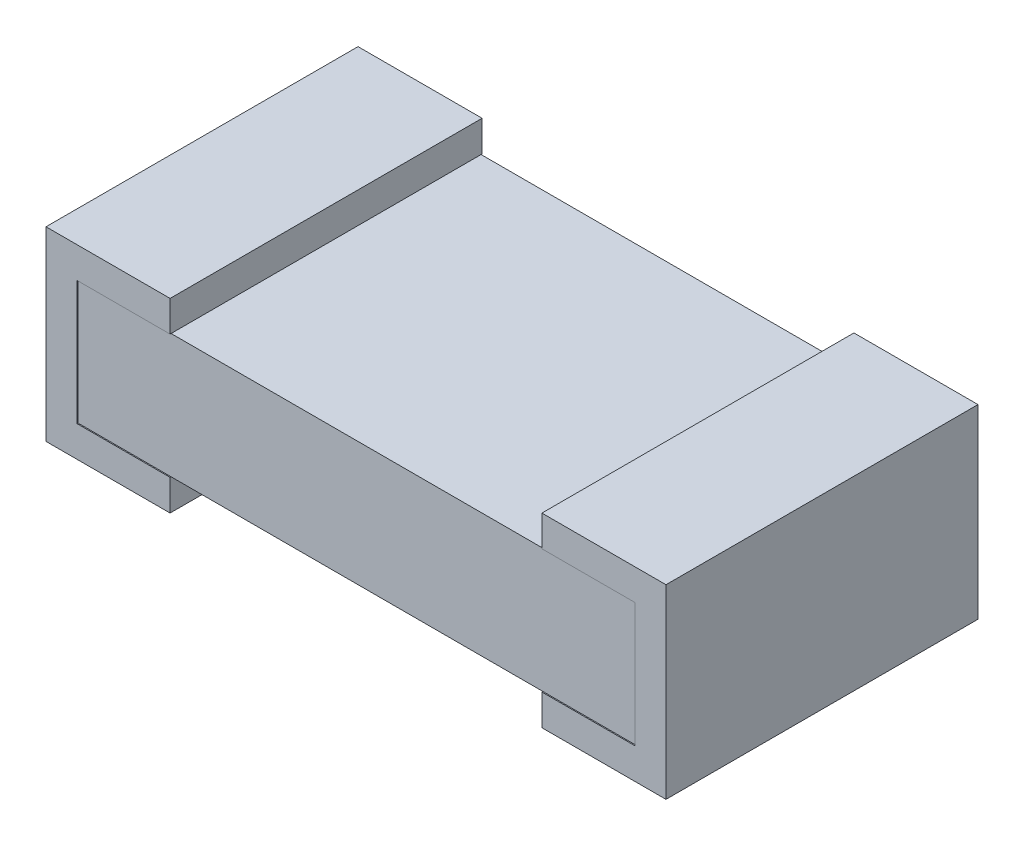
ISO-10303-21;
HEADER;
FILE_DESCRIPTION(('STEP AP214'),'2;1');
FILE_NAME('part.step','',(''),(''),'','','');
FILE_SCHEMA(('AUTOMOTIVE_DESIGN { 1 0 10303 214 1 1 1 1 }'));
ENDSEC;
DATA;
#1=APPLICATION_CONTEXT('core data for automotive mechanical design processes');
#2=APPLICATION_PROTOCOL_DEFINITION('international standard','automotive_design',2000,#1);
#3=PRODUCT_CONTEXT('',#1,'mechanical');
#4=PRODUCT('Part','Part','',(#3));
#5=PRODUCT_RELATED_PRODUCT_CATEGORY('part','',(#4));
#6=PRODUCT_DEFINITION_FORMATION('','',#4);
#7=PRODUCT_DEFINITION_CONTEXT('part definition',#1,'design');
#8=PRODUCT_DEFINITION('design','',#6,#7);
#9=PRODUCT_DEFINITION_SHAPE('','',#8);
#10=(LENGTH_UNIT() NAMED_UNIT(*) SI_UNIT(.MILLI.,.METRE.));
#11=(NAMED_UNIT(*) PLANE_ANGLE_UNIT() SI_UNIT($,.RADIAN.));
#12=(NAMED_UNIT(*) SI_UNIT($,.STERADIAN.) SOLID_ANGLE_UNIT());
#13=UNCERTAINTY_MEASURE_WITH_UNIT(LENGTH_MEASURE(1.E-05),#10,'distance_accuracy_value','');
#14=(GEOMETRIC_REPRESENTATION_CONTEXT(3) GLOBAL_UNCERTAINTY_ASSIGNED_CONTEXT((#13)) GLOBAL_UNIT_ASSIGNED_CONTEXT((#10,
#11,#12)) REPRESENTATION_CONTEXT('',''));
#15=CARTESIAN_POINT('',(0.,0.,0.));
#16=DIRECTION('',(0.,0.,1.));
#17=DIRECTION('',(1.,0.,0.));
#18=AXIS2_PLACEMENT_3D('',#15,#16,#17);
#19=CARTESIAN_POINT('',(-0.457,-0.2285,0.3835));
#20=DIRECTION('',(0.,1.,0.));
#21=DIRECTION('',(-1.,0.,0.));
#22=AXIS2_PLACEMENT_3D('',#19,#20,#21);
#23=PLANE('',#22);
#24=DIRECTION('',(0.,0.,1.));
#25=VECTOR('',#24,1.);
#26=CARTESIAN_POINT('',(-0.457,-0.2285,0.3835));
#27=LINE('',#26,#25);
#28=CARTESIAN_POINT('',(-0.457,-0.2285,-0.3835));
#29=VERTEX_POINT('',#28);
#30=CARTESIAN_POINT('',(-0.457,-0.2285,0.3835));
#31=VERTEX_POINT('',#30);
#32=EDGE_CURVE('E180',#29,#31,#27,.T.);
#33=ORIENTED_EDGE('',*,*,#32,.T.);
#34=DIRECTION('',(-1.,0.,0.));
#35=VECTOR('',#34,1.);
#36=CARTESIAN_POINT('',(-0.457,-0.2285,0.3835));
#37=LINE('',#36,#35);
#38=CARTESIAN_POINT('',(-0.762,-0.2285,0.3835));
#39=VERTEX_POINT('',#38);
#40=EDGE_CURVE('E182',#31,#39,#37,.T.);
#41=ORIENTED_EDGE('',*,*,#40,.T.);
#42=DIRECTION('',(0.,0.,-1.));
#43=VECTOR('',#42,1.);
#44=CARTESIAN_POINT('',(-0.762,-0.2285,0.3835));
#45=LINE('',#44,#43);
#46=CARTESIAN_POINT('',(-0.762,-0.2285,-0.3835));
#47=VERTEX_POINT('',#46);
#48=EDGE_CURVE('E20',#39,#47,#45,.T.);
#49=ORIENTED_EDGE('',*,*,#48,.T.);
#50=DIRECTION('',(-1.,0.,0.));
#51=VECTOR('',#50,1.);
#52=CARTESIAN_POINT('',(-0.457,-0.2285,-0.3835));
#53=LINE('',#52,#51);
#54=EDGE_CURVE('E183',#29,#47,#53,.T.);
#55=ORIENTED_EDGE('',*,*,#54,.F.);
#56=EDGE_LOOP('',(#33,#41,#49,#55));
#57=FACE_BOUND('',#56,.T.);
#58=ADVANCED_FACE('F17',(#57),#23,.F.);
#59=CARTESIAN_POINT('',(-0.762,-0.2285,0.3835));
#60=DIRECTION('',(1.,0.,0.));
#61=DIRECTION('',(0.,0.,-1.));
#62=AXIS2_PLACEMENT_3D('',#59,#60,#61);
#63=PLANE('',#62);
#64=ORIENTED_EDGE('',*,*,#48,.F.);
#65=DIRECTION('',(0.,1.,0.));
#66=VECTOR('',#65,1.);
#67=CARTESIAN_POINT('',(-0.762,0.1525,0.3835));
#68=LINE('',#67,#66);
#69=CARTESIAN_POINT('',(-0.762,0.2285,0.3835));
#70=VERTEX_POINT('',#69);
#71=EDGE_CURVE('E195',#39,#70,#68,.T.);
#72=ORIENTED_EDGE('',*,*,#71,.T.);
#73=DIRECTION('',(0.,0.,-1.));
#74=VECTOR('',#73,1.);
#75=CARTESIAN_POINT('',(-0.762,0.2285,0.3835));
#76=LINE('',#75,#74);
#77=CARTESIAN_POINT('',(-0.762,0.2285,-0.3835));
#78=VERTEX_POINT('',#77);
#79=EDGE_CURVE('E213',#70,#78,#76,.T.);
#80=ORIENTED_EDGE('',*,*,#79,.T.);
#81=DIRECTION('',(0.,1.,0.));
#82=VECTOR('',#81,1.);
#83=CARTESIAN_POINT('',(-0.762,0.1525,-0.3835));
#84=LINE('',#83,#82);
#85=EDGE_CURVE('E210',#47,#78,#84,.T.);
#86=ORIENTED_EDGE('',*,*,#85,.F.);
#87=EDGE_LOOP('',(#64,#72,#80,#86));
#88=FACE_BOUND('',#87,.T.);
#89=ADVANCED_FACE('F211',(#88),#63,.F.);
#90=CARTESIAN_POINT('',(0.457,-0.2285,0.3835));
#91=DIRECTION('',(0.,-1.,0.));
#92=DIRECTION('',(1.,0.,0.));
#93=AXIS2_PLACEMENT_3D('',#90,#91,#92);
#94=PLANE('',#93);
#95=DIRECTION('',(-1.,0.,0.));
#96=VECTOR('',#95,1.);
#97=CARTESIAN_POINT('',(0.457,-0.2285,0.3835));
#98=LINE('',#97,#96);
#99=CARTESIAN_POINT('',(0.762,-0.2285,0.3835));
#100=VERTEX_POINT('',#99);
#101=CARTESIAN_POINT('',(0.457,-0.2285,0.3835));
#102=VERTEX_POINT('',#101);
#103=EDGE_CURVE('E290',#100,#102,#98,.T.);
#104=ORIENTED_EDGE('',*,*,#103,.T.);
#105=DIRECTION('',(0.,0.,1.));
#106=VECTOR('',#105,1.);
#107=CARTESIAN_POINT('',(0.457,-0.2285,0.3835));
#108=LINE('',#107,#106);
#109=CARTESIAN_POINT('',(0.457,-0.2285,-0.3835));
#110=VERTEX_POINT('',#109);
#111=EDGE_CURVE('E188',#110,#102,#108,.T.);
#112=ORIENTED_EDGE('',*,*,#111,.F.);
#113=DIRECTION('',(-1.,0.,0.));
#114=VECTOR('',#113,1.);
#115=CARTESIAN_POINT('',(0.457,-0.2285,-0.3835));
#116=LINE('',#115,#114);
#117=CARTESIAN_POINT('',(0.762,-0.2285,-0.3835));
#118=VERTEX_POINT('',#117);
#119=EDGE_CURVE('E307',#118,#110,#116,.T.);
#120=ORIENTED_EDGE('',*,*,#119,.F.);
#121=DIRECTION('',(0.,0.,-1.));
#122=VECTOR('',#121,1.);
#123=CARTESIAN_POINT('',(0.762,-0.2285,0.3835));
#124=LINE('',#123,#122);
#125=EDGE_CURVE('E205',#100,#118,#124,.T.);
#126=ORIENTED_EDGE('',*,*,#125,.F.);
#127=EDGE_LOOP('',(#104,#112,#120,#126));
#128=FACE_BOUND('',#127,.T.);
#129=ADVANCED_FACE('F460',(#128),#94,.T.);
#130=CARTESIAN_POINT('',(0.762,-0.2285,0.3835));
#131=DIRECTION('',(1.,0.,0.));
#132=DIRECTION('',(0.,0.,-1.));
#133=AXIS2_PLACEMENT_3D('',#130,#131,#132);
#134=PLANE('',#133);
#135=DIRECTION('',(0.,1.,0.));
#136=VECTOR('',#135,1.);
#137=CARTESIAN_POINT('',(0.762,0.1525,0.3835));
#138=LINE('',#137,#136);
#139=CARTESIAN_POINT('',(0.762,0.2285,0.3835));
#140=VERTEX_POINT('',#139);
#141=EDGE_CURVE('E293',#140,#100,#138,.F.);
#142=ORIENTED_EDGE('',*,*,#141,.T.);
#143=ORIENTED_EDGE('',*,*,#125,.T.);
#144=DIRECTION('',(0.,1.,0.));
#145=VECTOR('',#144,1.);
#146=CARTESIAN_POINT('',(0.762,0.1525,-0.3835));
#147=LINE('',#146,#145);
#148=CARTESIAN_POINT('',(0.762,0.2285,-0.3835));
#149=VERTEX_POINT('',#148);
#150=EDGE_CURVE('E309',#149,#118,#147,.F.);
#151=ORIENTED_EDGE('',*,*,#150,.F.);
#152=DIRECTION('',(0.,0.,1.));
#153=VECTOR('',#152,1.);
#154=CARTESIAN_POINT('',(0.762,0.2285,0.3835));
#155=LINE('',#154,#153);
#156=EDGE_CURVE('E279',#140,#149,#155,.F.);
#157=ORIENTED_EDGE('',*,*,#156,.F.);
#158=EDGE_LOOP('',(#142,#143,#151,#157));
#159=FACE_BOUND('',#158,.T.);
#160=ADVANCED_FACE('F462',(#159),#134,.T.);
#161=CARTESIAN_POINT('',(0.457,-0.1525,0.3835));
#162=DIRECTION('',(-1.,0.,0.));
#163=DIRECTION('',(0.,-1.,0.));
#164=AXIS2_PLACEMENT_3D('',#161,#162,#163);
#165=PLANE('',#164);
#166=DIRECTION('',(0.,0.,1.));
#167=VECTOR('',#166,1.);
#168=CARTESIAN_POINT('',(0.457,-0.1525,0.381));
#169=LINE('',#168,#167);
#170=CARTESIAN_POINT('',(0.457,-0.1525,0.381));
#171=VERTEX_POINT('',#170);
#172=CARTESIAN_POINT('',(0.457,-0.1525,-0.381));
#173=VERTEX_POINT('',#172);
#174=EDGE_CURVE('E270',#171,#173,#169,.F.);
#175=ORIENTED_EDGE('',*,*,#174,.T.);
#176=DIRECTION('',(0.,0.,1.));
#177=VECTOR('',#176,1.);
#178=CARTESIAN_POINT('',(0.457,-0.1525,0.3835));
#179=LINE('',#178,#177);
#180=CARTESIAN_POINT('',(0.457,-0.1525,-0.3835));
#181=VERTEX_POINT('',#180);
#182=EDGE_CURVE('E218',#181,#173,#179,.T.);
#183=ORIENTED_EDGE('',*,*,#182,.F.);
#184=DIRECTION('',(0.,1.,0.));
#185=VECTOR('',#184,1.);
#186=CARTESIAN_POINT('',(0.457,0.1525,-0.3835));
#187=LINE('',#186,#185);
#188=EDGE_CURVE('E305',#110,#181,#187,.T.);
#189=ORIENTED_EDGE('',*,*,#188,.F.);
#190=ORIENTED_EDGE('',*,*,#111,.T.);
#191=DIRECTION('',(0.,1.,0.));
#192=VECTOR('',#191,1.);
#193=CARTESIAN_POINT('',(0.457,0.1525,0.3835));
#194=LINE('',#193,#192);
#195=CARTESIAN_POINT('',(0.457,-0.1525,0.3835));
#196=VERTEX_POINT('',#195);
#197=EDGE_CURVE('E287',#102,#196,#194,.T.);
#198=ORIENTED_EDGE('',*,*,#197,.T.);
#199=DIRECTION('',(0.,0.,1.));
#200=VECTOR('',#199,1.);
#201=CARTESIAN_POINT('',(0.457,-0.1525,0.3835));
#202=LINE('',#201,#200);
#203=EDGE_CURVE('E277',#171,#196,#202,.T.);
#204=ORIENTED_EDGE('',*,*,#203,.F.);
#205=EDGE_LOOP('',(#175,#183,#189,#190,#198,#204));
#206=FACE_BOUND('',#205,.T.);
#207=ADVANCED_FACE('F350',(#206),#165,.T.);
#208=CARTESIAN_POINT('',(-0.457,-0.1525,0.3835));
#209=DIRECTION('',(-1.,0.,0.));
#210=DIRECTION('',(0.,-1.,0.));
#211=AXIS2_PLACEMENT_3D('',#208,#209,#210);
#212=PLANE('',#211);
#213=DIRECTION('',(0.,0.,-1.));
#214=VECTOR('',#213,1.);
#215=CARTESIAN_POINT('',(-0.457,-0.1525,0.3835));
#216=LINE('',#215,#214);
#217=CARTESIAN_POINT('',(-0.457,-0.1525,-0.3835));
#218=VERTEX_POINT('',#217);
#219=CARTESIAN_POINT('',(-0.457,-0.1525,-0.381));
#220=VERTEX_POINT('',#219);
#221=EDGE_CURVE('E323',#218,#220,#216,.F.);
#222=ORIENTED_EDGE('',*,*,#221,.T.);
#223=DIRECTION('',(0.,0.,1.));
#224=VECTOR('',#223,1.);
#225=CARTESIAN_POINT('',(-0.457,-0.1525,0.381));
#226=LINE('',#225,#224);
#227=CARTESIAN_POINT('',(-0.457,-0.1525,0.381));
#228=VERTEX_POINT('',#227);
#229=EDGE_CURVE('E273',#220,#228,#226,.T.);
#230=ORIENTED_EDGE('',*,*,#229,.T.);
#231=DIRECTION('',(0.,0.,-1.));
#232=VECTOR('',#231,1.);
#233=CARTESIAN_POINT('',(-0.457,-0.1525,0.3835));
#234=LINE('',#233,#232);
#235=CARTESIAN_POINT('',(-0.457,-0.1525,0.3835));
#236=VERTEX_POINT('',#235);
#237=EDGE_CURVE('E201',#228,#236,#234,.F.);
#238=ORIENTED_EDGE('',*,*,#237,.T.);
#239=DIRECTION('',(0.,1.,0.));
#240=VECTOR('',#239,1.);
#241=CARTESIAN_POINT('',(-0.457,0.1525,0.3835));
#242=LINE('',#241,#240);
#243=EDGE_CURVE('E187',#236,#31,#242,.F.);
#244=ORIENTED_EDGE('',*,*,#243,.T.);
#245=ORIENTED_EDGE('',*,*,#32,.F.);
#246=DIRECTION('',(0.,1.,0.));
#247=VECTOR('',#246,1.);
#248=CARTESIAN_POINT('',(-0.457,0.1525,-0.3835));
#249=LINE('',#248,#247);
#250=EDGE_CURVE('E220',#218,#29,#249,.F.);
#251=ORIENTED_EDGE('',*,*,#250,.F.);
#252=EDGE_LOOP('',(#222,#230,#238,#244,#245,#251));
#253=FACE_BOUND('',#252,.T.);
#254=ADVANCED_FACE('F199',(#253),#212,.F.);
#255=CARTESIAN_POINT('',(-0.457,0.1525,0.3835));
#256=DIRECTION('',(0.,0.,-1.));
#257=DIRECTION('',(-1.,0.,0.));
#258=AXIS2_PLACEMENT_3D('',#255,#256,#257);
#259=PLANE('',#258);
#260=DIRECTION('',(1.,0.,0.));
#261=VECTOR('',#260,1.);
#262=CARTESIAN_POINT('',(-0.762,0.2285,0.3835));
#263=LINE('',#262,#261);
#264=CARTESIAN_POINT('',(-0.457,0.2285,0.3835));
#265=VERTEX_POINT('',#264);
#266=EDGE_CURVE('E226',#265,#70,#263,.F.);
#267=ORIENTED_EDGE('',*,*,#266,.T.);
#268=ORIENTED_EDGE('',*,*,#71,.F.);
#269=ORIENTED_EDGE('',*,*,#40,.F.);
#270=ORIENTED_EDGE('',*,*,#243,.F.);
#271=DIRECTION('',(1.,0.,0.));
#272=VECTOR('',#271,1.);
#273=CARTESIAN_POINT('',(-0.686,-0.1525,0.3835));
#274=LINE('',#273,#272);
#275=CARTESIAN_POINT('',(-0.686,-0.1525,0.3835));
#276=VERTEX_POINT('',#275);
#277=EDGE_CURVE('E268',#236,#276,#274,.F.);
#278=ORIENTED_EDGE('',*,*,#277,.T.);
#279=DIRECTION('',(0.,1.,0.));
#280=VECTOR('',#279,1.);
#281=CARTESIAN_POINT('',(-0.686,0.1525,0.3835));
#282=LINE('',#281,#280);
#283=CARTESIAN_POINT('',(-0.686,0.1525,0.3835));
#284=VERTEX_POINT('',#283);
#285=EDGE_CURVE('E265',#276,#284,#282,.T.);
#286=ORIENTED_EDGE('',*,*,#285,.T.);
#287=DIRECTION('',(1.,0.,0.));
#288=VECTOR('',#287,1.);
#289=CARTESIAN_POINT('',(-0.457,0.1525,0.3835));
#290=LINE('',#289,#288);
#291=CARTESIAN_POINT('',(-0.457,0.1525,0.3835));
#292=VERTEX_POINT('',#291);
#293=EDGE_CURVE('E235',#284,#292,#290,.T.);
#294=ORIENTED_EDGE('',*,*,#293,.T.);
#295=DIRECTION('',(0.,-1.,0.));
#296=VECTOR('',#295,1.);
#297=CARTESIAN_POINT('',(-0.457,0.2285,0.3835));
#298=LINE('',#297,#296);
#299=EDGE_CURVE('E233',#292,#265,#298,.F.);
#300=ORIENTED_EDGE('',*,*,#299,.T.);
#301=EDGE_LOOP('',(#267,#268,#269,#270,#278,#286,#294,#300));
#302=FACE_BOUND('',#301,.T.);
#303=ADVANCED_FACE('F192',(#302),#259,.F.);
#304=CARTESIAN_POINT('',(-0.762,0.2285,0.3835));
#305=DIRECTION('',(0.,-1.,0.));
#306=DIRECTION('',(0.,0.,-1.));
#307=AXIS2_PLACEMENT_3D('',#304,#305,#306);
#308=PLANE('',#307);
#309=ORIENTED_EDGE('',*,*,#79,.F.);
#310=ORIENTED_EDGE('',*,*,#266,.F.);
#311=DIRECTION('',(0.,0.,1.));
#312=VECTOR('',#311,1.);
#313=CARTESIAN_POINT('',(-0.457,0.2285,0.3835));
#314=LINE('',#313,#312);
#315=CARTESIAN_POINT('',(-0.457,0.2285,-0.3835));
#316=VERTEX_POINT('',#315);
#317=EDGE_CURVE('E238',#265,#316,#314,.F.);
#318=ORIENTED_EDGE('',*,*,#317,.T.);
#319=DIRECTION('',(-1.,0.,0.));
#320=VECTOR('',#319,1.);
#321=CARTESIAN_POINT('',(-0.457,0.2285,-0.3835));
#322=LINE('',#321,#320);
#323=EDGE_CURVE('E216',#78,#316,#322,.F.);
#324=ORIENTED_EDGE('',*,*,#323,.F.);
#325=EDGE_LOOP('',(#309,#310,#318,#324));
#326=FACE_BOUND('',#325,.T.);
#327=ADVANCED_FACE('F228',(#326),#308,.F.);
#328=CARTESIAN_POINT('',(-0.457,0.1525,-0.3835));
#329=DIRECTION('',(0.,0.,-1.));
#330=DIRECTION('',(-1.,0.,0.));
#331=AXIS2_PLACEMENT_3D('',#328,#329,#330);
#332=PLANE('',#331);
#333=ORIENTED_EDGE('',*,*,#85,.T.);
#334=ORIENTED_EDGE('',*,*,#323,.T.);
#335=DIRECTION('',(0.,-1.,0.));
#336=VECTOR('',#335,1.);
#337=CARTESIAN_POINT('',(-0.457,0.2285,-0.3835));
#338=LINE('',#337,#336);
#339=CARTESIAN_POINT('',(-0.457,0.1525,-0.3835));
#340=VERTEX_POINT('',#339);
#341=EDGE_CURVE('E241',#316,#340,#338,.T.);
#342=ORIENTED_EDGE('',*,*,#341,.T.);
#343=DIRECTION('',(1.,0.,0.));
#344=VECTOR('',#343,1.);
#345=CARTESIAN_POINT('',(-0.457,0.1525,-0.3835));
#346=LINE('',#345,#344);
#347=CARTESIAN_POINT('',(-0.686,0.1525,-0.3835));
#348=VERTEX_POINT('',#347);
#349=EDGE_CURVE('E314',#340,#348,#346,.F.);
#350=ORIENTED_EDGE('',*,*,#349,.T.);
#351=DIRECTION('',(0.,1.,0.));
#352=VECTOR('',#351,1.);
#353=CARTESIAN_POINT('',(-0.686,0.1525,-0.3835));
#354=LINE('',#353,#352);
#355=CARTESIAN_POINT('',(-0.686,-0.1525,-0.3835));
#356=VERTEX_POINT('',#355);
#357=EDGE_CURVE('E320',#348,#356,#354,.F.);
#358=ORIENTED_EDGE('',*,*,#357,.T.);
#359=DIRECTION('',(1.,0.,0.));
#360=VECTOR('',#359,1.);
#361=CARTESIAN_POINT('',(-0.686,-0.1525,-0.3835));
#362=LINE('',#361,#360);
#363=EDGE_CURVE('E325',#356,#218,#362,.T.);
#364=ORIENTED_EDGE('',*,*,#363,.T.);
#365=ORIENTED_EDGE('',*,*,#250,.T.);
#366=ORIENTED_EDGE('',*,*,#54,.T.);
#367=EDGE_LOOP('',(#333,#334,#342,#350,#358,#364,#365,#366));
#368=FACE_BOUND('',#367,.T.);
#369=ADVANCED_FACE('F363',(#368),#332,.T.);
#370=CARTESIAN_POINT('',(0.686,0.1525,0.3835));
#371=DIRECTION('',(-1.,0.,0.));
#372=DIRECTION('',(0.,0.,1.));
#373=AXIS2_PLACEMENT_3D('',#370,#371,#372);
#374=PLANE('',#373);
#375=DIRECTION('',(0.,0.,-1.));
#376=VECTOR('',#375,1.);
#377=CARTESIAN_POINT('',(0.686,0.1525,0.3835));
#378=LINE('',#377,#376);
#379=CARTESIAN_POINT('',(0.686,0.1525,-0.3835));
#380=VERTEX_POINT('',#379);
#381=CARTESIAN_POINT('',(0.686,0.1525,-0.381));
#382=VERTEX_POINT('',#381);
#383=EDGE_CURVE('E298',#380,#382,#378,.F.);
#384=ORIENTED_EDGE('',*,*,#383,.F.);
#385=DIRECTION('',(0.,1.,0.));
#386=VECTOR('',#385,1.);
#387=CARTESIAN_POINT('',(0.686,0.1525,-0.3835));
#388=LINE('',#387,#386);
#389=CARTESIAN_POINT('',(0.686,-0.1525,-0.3835));
#390=VERTEX_POINT('',#389);
#391=EDGE_CURVE('E300',#390,#380,#388,.T.);
#392=ORIENTED_EDGE('',*,*,#391,.F.);
#393=DIRECTION('',(0.,0.,1.));
#394=VECTOR('',#393,1.);
#395=CARTESIAN_POINT('',(0.686,-0.1525,0.3835));
#396=LINE('',#395,#394);
#397=CARTESIAN_POINT('',(0.686,-0.1525,-0.381));
#398=VERTEX_POINT('',#397);
#399=EDGE_CURVE('E328',#398,#390,#396,.F.);
#400=ORIENTED_EDGE('',*,*,#399,.F.);
#401=DIRECTION('',(0.,1.,0.));
#402=VECTOR('',#401,1.);
#403=CARTESIAN_POINT('',(0.686,0.1525,-0.381));
#404=LINE('',#403,#402);
#405=EDGE_CURVE('E346',#382,#398,#404,.F.);
#406=ORIENTED_EDGE('',*,*,#405,.F.);
#407=EDGE_LOOP('',(#384,#392,#400,#406));
#408=FACE_BOUND('',#407,.T.);
#409=ADVANCED_FACE('F446',(#408),#374,.T.);
#410=CARTESIAN_POINT('',(0.686,-0.1525,0.3835));
#411=DIRECTION('',(0.,1.,0.));
#412=DIRECTION('',(0.,0.,1.));
#413=AXIS2_PLACEMENT_3D('',#410,#411,#412);
#414=PLANE('',#413);
#415=ORIENTED_EDGE('',*,*,#399,.T.);
#416=DIRECTION('',(-1.,0.,0.));
#417=VECTOR('',#416,1.);
#418=CARTESIAN_POINT('',(0.457,-0.1525,-0.3835));
#419=LINE('',#418,#417);
#420=EDGE_CURVE('E302',#181,#390,#419,.F.);
#421=ORIENTED_EDGE('',*,*,#420,.F.);
#422=ORIENTED_EDGE('',*,*,#182,.T.);
#423=DIRECTION('',(-1.,0.,0.));
#424=VECTOR('',#423,1.);
#425=CARTESIAN_POINT('',(0.686,-0.1525,-0.381));
#426=LINE('',#425,#424);
#427=EDGE_CURVE('E335',#398,#173,#426,.T.);
#428=ORIENTED_EDGE('',*,*,#427,.F.);
#429=EDGE_LOOP('',(#415,#421,#422,#428));
#430=FACE_BOUND('',#429,.T.);
#431=ADVANCED_FACE('F334',(#430),#414,.T.);
#432=CARTESIAN_POINT('',(-0.686,-0.1525,0.3835));
#433=DIRECTION('',(0.,-1.,0.));
#434=DIRECTION('',(0.,0.,-1.));
#435=AXIS2_PLACEMENT_3D('',#432,#433,#434);
#436=PLANE('',#435);
#437=ORIENTED_EDGE('',*,*,#221,.F.);
#438=ORIENTED_EDGE('',*,*,#363,.F.);
#439=DIRECTION('',(0.,0.,1.));
#440=VECTOR('',#439,1.);
#441=CARTESIAN_POINT('',(-0.686,-0.1525,0.3835));
#442=LINE('',#441,#440);
#443=CARTESIAN_POINT('',(-0.686,-0.1525,-0.381));
#444=VERTEX_POINT('',#443);
#445=EDGE_CURVE('E317',#356,#444,#442,.T.);
#446=ORIENTED_EDGE('',*,*,#445,.T.);
#447=DIRECTION('',(-1.,0.,0.));
#448=VECTOR('',#447,1.);
#449=CARTESIAN_POINT('',(0.686,-0.1525,-0.381));
#450=LINE('',#449,#448);
#451=EDGE_CURVE('E355',#220,#444,#450,.T.);
#452=ORIENTED_EDGE('',*,*,#451,.F.);
#453=EDGE_LOOP('',(#437,#438,#446,#452));
#454=FACE_BOUND('',#453,.T.);
#455=ADVANCED_FACE('F424',(#454),#436,.F.);
#456=CARTESIAN_POINT('',(-0.686,0.1525,0.3835));
#457=DIRECTION('',(-1.,0.,0.));
#458=DIRECTION('',(0.,0.,1.));
#459=AXIS2_PLACEMENT_3D('',#456,#457,#458);
#460=PLANE('',#459);
#461=ORIENTED_EDGE('',*,*,#445,.F.);
#462=ORIENTED_EDGE('',*,*,#357,.F.);
#463=DIRECTION('',(0.,0.,1.));
#464=VECTOR('',#463,1.);
#465=CARTESIAN_POINT('',(-0.686,0.1525,0.3835));
#466=LINE('',#465,#464);
#467=CARTESIAN_POINT('',(-0.686,0.1525,-0.381));
#468=VERTEX_POINT('',#467);
#469=EDGE_CURVE('E311',#348,#468,#466,.T.);
#470=ORIENTED_EDGE('',*,*,#469,.T.);
#471=DIRECTION('',(0.,1.,0.));
#472=VECTOR('',#471,1.);
#473=CARTESIAN_POINT('',(-0.686,0.1525,-0.381));
#474=LINE('',#473,#472);
#475=EDGE_CURVE('E357',#444,#468,#474,.T.);
#476=ORIENTED_EDGE('',*,*,#475,.F.);
#477=EDGE_LOOP('',(#461,#462,#470,#476));
#478=FACE_BOUND('',#477,.T.);
#479=ADVANCED_FACE('F421',(#478),#460,.F.);
#480=CARTESIAN_POINT('',(-0.457,0.1525,0.3835));
#481=DIRECTION('',(0.,1.,0.));
#482=DIRECTION('',(0.,0.,1.));
#483=AXIS2_PLACEMENT_3D('',#480,#481,#482);
#484=PLANE('',#483);
#485=ORIENTED_EDGE('',*,*,#469,.F.);
#486=ORIENTED_EDGE('',*,*,#349,.F.);
#487=DIRECTION('',(0.,0.,1.));
#488=VECTOR('',#487,1.);
#489=CARTESIAN_POINT('',(-0.457,0.1525,0.3835));
#490=LINE('',#489,#488);
#491=CARTESIAN_POINT('',(-0.457,0.1525,-0.381));
#492=VERTEX_POINT('',#491);
#493=EDGE_CURVE('E243',#340,#492,#490,.T.);
#494=ORIENTED_EDGE('',*,*,#493,.T.);
#495=DIRECTION('',(-1.,0.,0.));
#496=VECTOR('',#495,1.);
#497=CARTESIAN_POINT('',(0.686,0.1525,-0.381));
#498=LINE('',#497,#496);
#499=EDGE_CURVE('E374',#468,#492,#498,.F.);
#500=ORIENTED_EDGE('',*,*,#499,.F.);
#501=EDGE_LOOP('',(#485,#486,#494,#500));
#502=FACE_BOUND('',#501,.T.);
#503=ADVANCED_FACE('F373',(#502),#484,.F.);
#504=CARTESIAN_POINT('',(0.457,0.1525,-0.3835));
#505=DIRECTION('',(0.,0.,-1.));
#506=DIRECTION('',(-1.,0.,0.));
#507=AXIS2_PLACEMENT_3D('',#504,#505,#506);
#508=PLANE('',#507);
#509=ORIENTED_EDGE('',*,*,#391,.T.);
#510=DIRECTION('',(1.,0.,0.));
#511=VECTOR('',#510,1.);
#512=CARTESIAN_POINT('',(0.457,0.1525,-0.3835));
#513=LINE('',#512,#511);
#514=CARTESIAN_POINT('',(0.457,0.1525,-0.3835));
#515=VERTEX_POINT('',#514);
#516=EDGE_CURVE('E295',#515,#380,#513,.T.);
#517=ORIENTED_EDGE('',*,*,#516,.F.);
#518=DIRECTION('',(0.,-1.,0.));
#519=VECTOR('',#518,1.);
#520=CARTESIAN_POINT('',(0.457,0.2285,-0.3835));
#521=LINE('',#520,#519);
#522=CARTESIAN_POINT('',(0.457,0.2285,-0.3835));
#523=VERTEX_POINT('',#522);
#524=EDGE_CURVE('E413',#523,#515,#521,.T.);
#525=ORIENTED_EDGE('',*,*,#524,.F.);
#526=DIRECTION('',(1.,0.,0.));
#527=VECTOR('',#526,1.);
#528=CARTESIAN_POINT('',(0.762,0.2285,-0.3835));
#529=LINE('',#528,#527);
#530=EDGE_CURVE('E285',#149,#523,#529,.F.);
#531=ORIENTED_EDGE('',*,*,#530,.F.);
#532=ORIENTED_EDGE('',*,*,#150,.T.);
#533=ORIENTED_EDGE('',*,*,#119,.T.);
#534=ORIENTED_EDGE('',*,*,#188,.T.);
#535=ORIENTED_EDGE('',*,*,#420,.T.);
#536=EDGE_LOOP('',(#509,#517,#525,#531,#532,#533,#534,#535));
#537=FACE_BOUND('',#536,.T.);
#538=ADVANCED_FACE('F449',(#537),#508,.T.);
#539=CARTESIAN_POINT('',(0.457,0.1525,0.3835));
#540=DIRECTION('',(0.,-1.,0.));
#541=DIRECTION('',(0.,0.,-1.));
#542=AXIS2_PLACEMENT_3D('',#539,#540,#541);
#543=PLANE('',#542);
#544=DIRECTION('',(0.,0.,1.));
#545=VECTOR('',#544,1.);
#546=CARTESIAN_POINT('',(0.457,0.1525,0.3835));
#547=LINE('',#546,#545);
#548=CARTESIAN_POINT('',(0.457,0.1525,-0.381));
#549=VERTEX_POINT('',#548);
#550=EDGE_CURVE('E411',#515,#549,#547,.T.);
#551=ORIENTED_EDGE('',*,*,#550,.F.);
#552=ORIENTED_EDGE('',*,*,#516,.T.);
#553=ORIENTED_EDGE('',*,*,#383,.T.);
#554=DIRECTION('',(-1.,0.,0.));
#555=VECTOR('',#554,1.);
#556=CARTESIAN_POINT('',(0.686,0.1525,-0.381));
#557=LINE('',#556,#555);
#558=EDGE_CURVE('E415',#549,#382,#557,.F.);
#559=ORIENTED_EDGE('',*,*,#558,.F.);
#560=EDGE_LOOP('',(#551,#552,#553,#559));
#561=FACE_BOUND('',#560,.T.);
#562=ADVANCED_FACE('F443',(#561),#543,.T.);
#563=CARTESIAN_POINT('',(0.457,0.1525,0.3835));
#564=DIRECTION('',(0.,0.,-1.));
#565=DIRECTION('',(-1.,0.,0.));
#566=AXIS2_PLACEMENT_3D('',#563,#564,#565);
#567=PLANE('',#566);
#568=DIRECTION('',(1.,0.,0.));
#569=VECTOR('',#568,1.);
#570=CARTESIAN_POINT('',(0.457,0.1525,0.3835));
#571=LINE('',#570,#569);
#572=CARTESIAN_POINT('',(0.686,0.1525,0.3835));
#573=VERTEX_POINT('',#572);
#574=CARTESIAN_POINT('',(0.457,0.1525,0.3835));
#575=VERTEX_POINT('',#574);
#576=EDGE_CURVE('E256',#573,#575,#571,.F.);
#577=ORIENTED_EDGE('',*,*,#576,.F.);
#578=DIRECTION('',(0.,1.,0.));
#579=VECTOR('',#578,1.);
#580=CARTESIAN_POINT('',(0.686,0.1525,0.3835));
#581=LINE('',#580,#579);
#582=CARTESIAN_POINT('',(0.686,-0.1525,0.3835));
#583=VERTEX_POINT('',#582);
#584=EDGE_CURVE('E251',#583,#573,#581,.T.);
#585=ORIENTED_EDGE('',*,*,#584,.F.);
#586=DIRECTION('',(1.,0.,0.));
#587=VECTOR('',#586,1.);
#588=CARTESIAN_POINT('',(0.686,-0.1525,0.3835));
#589=LINE('',#588,#587);
#590=EDGE_CURVE('E275',#196,#583,#589,.T.);
#591=ORIENTED_EDGE('',*,*,#590,.F.);
#592=ORIENTED_EDGE('',*,*,#197,.F.);
#593=ORIENTED_EDGE('',*,*,#103,.F.);
#594=ORIENTED_EDGE('',*,*,#141,.F.);
#595=DIRECTION('',(1.,0.,0.));
#596=VECTOR('',#595,1.);
#597=CARTESIAN_POINT('',(0.762,0.2285,0.3835));
#598=LINE('',#597,#596);
#599=CARTESIAN_POINT('',(0.457,0.2285,0.3835));
#600=VERTEX_POINT('',#599);
#601=EDGE_CURVE('E282',#600,#140,#598,.T.);
#602=ORIENTED_EDGE('',*,*,#601,.F.);
#603=DIRECTION('',(0.,-1.,0.));
#604=VECTOR('',#603,1.);
#605=CARTESIAN_POINT('',(0.457,0.2285,0.3835));
#606=LINE('',#605,#604);
#607=EDGE_CURVE('E406',#575,#600,#606,.F.);
#608=ORIENTED_EDGE('',*,*,#607,.F.);
#609=EDGE_LOOP('',(#577,#585,#591,#592,#593,#594,#602,#608));
#610=FACE_BOUND('',#609,.T.);
#611=ADVANCED_FACE('F458',(#610),#567,.F.);
#612=CARTESIAN_POINT('',(0.762,0.2285,0.3835));
#613=DIRECTION('',(0.,1.,0.));
#614=DIRECTION('',(0.,0.,1.));
#615=AXIS2_PLACEMENT_3D('',#612,#613,#614);
#616=PLANE('',#615);
#617=ORIENTED_EDGE('',*,*,#601,.T.);
#618=ORIENTED_EDGE('',*,*,#156,.T.);
#619=ORIENTED_EDGE('',*,*,#530,.T.);
#620=DIRECTION('',(0.,0.,1.));
#621=VECTOR('',#620,1.);
#622=CARTESIAN_POINT('',(0.457,0.2285,0.3835));
#623=LINE('',#622,#621);
#624=EDGE_CURVE('E403',#600,#523,#623,.F.);
#625=ORIENTED_EDGE('',*,*,#624,.F.);
#626=EDGE_LOOP('',(#617,#618,#619,#625));
#627=FACE_BOUND('',#626,.T.);
#628=ADVANCED_FACE('F502',(#627),#616,.T.);
#629=CARTESIAN_POINT('',(0.686,-0.1525,0.3835));
#630=DIRECTION('',(0.,1.,0.));
#631=DIRECTION('',(0.,0.,1.));
#632=AXIS2_PLACEMENT_3D('',#629,#630,#631);
#633=PLANE('',#632);
#634=ORIENTED_EDGE('',*,*,#590,.T.);
#635=DIRECTION('',(0.,0.,1.));
#636=VECTOR('',#635,1.);
#637=CARTESIAN_POINT('',(0.686,-0.1525,0.3835));
#638=LINE('',#637,#636);
#639=CARTESIAN_POINT('',(0.686,-0.1525,0.381));
#640=VERTEX_POINT('',#639);
#641=EDGE_CURVE('E253',#640,#583,#638,.T.);
#642=ORIENTED_EDGE('',*,*,#641,.F.);
#643=DIRECTION('',(-1.,0.,0.));
#644=VECTOR('',#643,1.);
#645=CARTESIAN_POINT('',(0.686,-0.1525,0.381));
#646=LINE('',#645,#644);
#647=EDGE_CURVE('E400',#640,#171,#646,.T.);
#648=ORIENTED_EDGE('',*,*,#647,.T.);
#649=ORIENTED_EDGE('',*,*,#203,.T.);
#650=EDGE_LOOP('',(#634,#642,#648,#649));
#651=FACE_BOUND('',#650,.T.);
#652=ADVANCED_FACE('F499',(#651),#633,.T.);
#653=CARTESIAN_POINT('',(-0.686,-0.1525,0.381));
#654=DIRECTION('',(0.,1.,0.));
#655=DIRECTION('',(0.,0.,1.));
#656=AXIS2_PLACEMENT_3D('',#653,#654,#655);
#657=PLANE('',#656);
#658=ORIENTED_EDGE('',*,*,#174,.F.);
#659=DIRECTION('',(-1.,0.,0.));
#660=VECTOR('',#659,1.);
#661=CARTESIAN_POINT('',(0.686,-0.1525,0.381));
#662=LINE('',#661,#660);
#663=EDGE_CURVE('E398',#171,#228,#662,.T.);
#664=ORIENTED_EDGE('',*,*,#663,.T.);
#665=ORIENTED_EDGE('',*,*,#229,.F.);
#666=DIRECTION('',(-1.,0.,0.));
#667=VECTOR('',#666,1.);
#668=CARTESIAN_POINT('',(0.686,-0.1525,-0.381));
#669=LINE('',#668,#667);
#670=EDGE_CURVE('E343',#173,#220,#669,.T.);
#671=ORIENTED_EDGE('',*,*,#670,.F.);
#672=EDGE_LOOP('',(#658,#664,#665,#671));
#673=FACE_BOUND('',#672,.T.);
#674=ADVANCED_FACE('F354',(#673),#657,.F.);
#675=CARTESIAN_POINT('',(-0.686,-0.1525,0.3835));
#676=DIRECTION('',(0.,-1.,0.));
#677=DIRECTION('',(0.,0.,-1.));
#678=AXIS2_PLACEMENT_3D('',#675,#676,#677);
#679=PLANE('',#678);
#680=DIRECTION('',(-1.,0.,0.));
#681=VECTOR('',#680,1.);
#682=CARTESIAN_POINT('',(0.686,-0.1525,0.381));
#683=LINE('',#682,#681);
#684=CARTESIAN_POINT('',(-0.686,-0.1525,0.381));
#685=VERTEX_POINT('',#684);
#686=EDGE_CURVE('E395',#228,#685,#683,.T.);
#687=ORIENTED_EDGE('',*,*,#686,.T.);
#688=DIRECTION('',(0.,0.,1.));
#689=VECTOR('',#688,1.);
#690=CARTESIAN_POINT('',(-0.686,-0.1525,0.3835));
#691=LINE('',#690,#689);
#692=EDGE_CURVE('E262',#685,#276,#691,.T.);
#693=ORIENTED_EDGE('',*,*,#692,.T.);
#694=ORIENTED_EDGE('',*,*,#277,.F.);
#695=ORIENTED_EDGE('',*,*,#237,.F.);
#696=EDGE_LOOP('',(#687,#693,#694,#695));
#697=FACE_BOUND('',#696,.T.);
#698=ADVANCED_FACE('F430',(#697),#679,.F.);
#699=CARTESIAN_POINT('',(-0.686,0.1525,0.3835));
#700=DIRECTION('',(-1.,0.,0.));
#701=DIRECTION('',(0.,0.,1.));
#702=AXIS2_PLACEMENT_3D('',#699,#700,#701);
#703=PLANE('',#702);
#704=DIRECTION('',(0.,1.,0.));
#705=VECTOR('',#704,1.);
#706=CARTESIAN_POINT('',(-0.686,0.1525,0.381));
#707=LINE('',#706,#705);
#708=CARTESIAN_POINT('',(-0.686,0.1525,0.381));
#709=VERTEX_POINT('',#708);
#710=EDGE_CURVE('E392',#685,#709,#707,.T.);
#711=ORIENTED_EDGE('',*,*,#710,.T.);
#712=DIRECTION('',(0.,0.,1.));
#713=VECTOR('',#712,1.);
#714=CARTESIAN_POINT('',(-0.686,0.1525,0.3835));
#715=LINE('',#714,#713);
#716=EDGE_CURVE('E258',#709,#284,#715,.T.);
#717=ORIENTED_EDGE('',*,*,#716,.T.);
#718=ORIENTED_EDGE('',*,*,#285,.F.);
#719=ORIENTED_EDGE('',*,*,#692,.F.);
#720=EDGE_LOOP('',(#711,#717,#718,#719));
#721=FACE_BOUND('',#720,.T.);
#722=ADVANCED_FACE('F432',(#721),#703,.F.);
#723=CARTESIAN_POINT('',(-0.457,0.1525,0.3835));
#724=DIRECTION('',(0.,1.,0.));
#725=DIRECTION('',(0.,0.,1.));
#726=AXIS2_PLACEMENT_3D('',#723,#724,#725);
#727=PLANE('',#726);
#728=DIRECTION('',(-1.,0.,0.));
#729=VECTOR('',#728,1.);
#730=CARTESIAN_POINT('',(0.686,0.1525,0.381));
#731=LINE('',#730,#729);
#732=CARTESIAN_POINT('',(-0.457,0.1525,0.381));
#733=VERTEX_POINT('',#732);
#734=EDGE_CURVE('E390',#709,#733,#731,.F.);
#735=ORIENTED_EDGE('',*,*,#734,.T.);
#736=DIRECTION('',(0.,0.,1.));
#737=VECTOR('',#736,1.);
#738=CARTESIAN_POINT('',(-0.457,0.1525,0.3835));
#739=LINE('',#738,#737);
#740=EDGE_CURVE('E239',#733,#292,#739,.T.);
#741=ORIENTED_EDGE('',*,*,#740,.T.);
#742=ORIENTED_EDGE('',*,*,#293,.F.);
#743=ORIENTED_EDGE('',*,*,#716,.F.);
#744=EDGE_LOOP('',(#735,#741,#742,#743));
#745=FACE_BOUND('',#744,.T.);
#746=ADVANCED_FACE('F434',(#745),#727,.F.);
#747=CARTESIAN_POINT('',(0.457,0.1525,0.3835));
#748=DIRECTION('',(0.,-1.,0.));
#749=DIRECTION('',(0.,0.,-1.));
#750=AXIS2_PLACEMENT_3D('',#747,#748,#749);
#751=PLANE('',#750);
#752=ORIENTED_EDGE('',*,*,#576,.T.);
#753=DIRECTION('',(0.,0.,1.));
#754=VECTOR('',#753,1.);
#755=CARTESIAN_POINT('',(0.457,0.1525,0.3835));
#756=LINE('',#755,#754);
#757=CARTESIAN_POINT('',(0.457,0.1525,0.381));
#758=VERTEX_POINT('',#757);
#759=EDGE_CURVE('E408',#758,#575,#756,.T.);
#760=ORIENTED_EDGE('',*,*,#759,.F.);
#761=DIRECTION('',(-1.,0.,0.));
#762=VECTOR('',#761,1.);
#763=CARTESIAN_POINT('',(0.686,0.1525,0.381));
#764=LINE('',#763,#762);
#765=CARTESIAN_POINT('',(0.686,0.1525,0.381));
#766=VERTEX_POINT('',#765);
#767=EDGE_CURVE('E34',#758,#766,#764,.F.);
#768=ORIENTED_EDGE('',*,*,#767,.T.);
#769=DIRECTION('',(0.,0.,1.));
#770=VECTOR('',#769,1.);
#771=CARTESIAN_POINT('',(0.686,0.1525,0.3835));
#772=LINE('',#771,#770);
#773=EDGE_CURVE('E249',#573,#766,#772,.F.);
#774=ORIENTED_EDGE('',*,*,#773,.F.);
#775=EDGE_LOOP('',(#752,#760,#768,#774));
#776=FACE_BOUND('',#775,.T.);
#777=ADVANCED_FACE('F486',(#776),#751,.T.);
#778=CARTESIAN_POINT('',(0.686,0.1525,0.3835));
#779=DIRECTION('',(-1.,0.,0.));
#780=DIRECTION('',(0.,0.,1.));
#781=AXIS2_PLACEMENT_3D('',#778,#779,#780);
#782=PLANE('',#781);
#783=ORIENTED_EDGE('',*,*,#584,.T.);
#784=ORIENTED_EDGE('',*,*,#773,.T.);
#785=DIRECTION('',(0.,1.,0.));
#786=VECTOR('',#785,1.);
#787=CARTESIAN_POINT('',(0.686,0.1525,0.381));
#788=LINE('',#787,#786);
#789=EDGE_CURVE('E384',#766,#640,#788,.F.);
#790=ORIENTED_EDGE('',*,*,#789,.T.);
#791=ORIENTED_EDGE('',*,*,#641,.T.);
#792=EDGE_LOOP('',(#783,#784,#790,#791));
#793=FACE_BOUND('',#792,.T.);
#794=ADVANCED_FACE('F483',(#793),#782,.T.);
#795=CARTESIAN_POINT('',(-0.457,0.2285,0.3835));
#796=DIRECTION('',(-1.,0.,0.));
#797=DIRECTION('',(0.,-1.,0.));
#798=AXIS2_PLACEMENT_3D('',#795,#796,#797);
#799=PLANE('',#798);
#800=ORIENTED_EDGE('',*,*,#317,.F.);
#801=ORIENTED_EDGE('',*,*,#299,.F.);
#802=ORIENTED_EDGE('',*,*,#740,.F.);
#803=DIRECTION('',(0.,0.,-1.));
#804=VECTOR('',#803,1.);
#805=CARTESIAN_POINT('',(-0.457,0.1525,0.381));
#806=LINE('',#805,#804);
#807=EDGE_CURVE('E368',#733,#492,#806,.T.);
#808=ORIENTED_EDGE('',*,*,#807,.T.);
#809=ORIENTED_EDGE('',*,*,#493,.F.);
#810=ORIENTED_EDGE('',*,*,#341,.F.);
#811=EDGE_LOOP('',(#800,#801,#802,#808,#809,#810));
#812=FACE_BOUND('',#811,.T.);
#813=ADVANCED_FACE('F365',(#812),#799,.F.);
#814=CARTESIAN_POINT('',(0.686,0.1525,-0.381));
#815=DIRECTION('',(0.,0.,-1.));
#816=DIRECTION('',(-1.,0.,0.));
#817=AXIS2_PLACEMENT_3D('',#814,#815,#816);
#818=PLANE('',#817);
#819=DIRECTION('',(1.,0.,0.));
#820=VECTOR('',#819,1.);
#821=CARTESIAN_POINT('',(-0.686,0.1525,-0.381));
#822=LINE('',#821,#820);
#823=EDGE_CURVE('E377',#492,#549,#822,.T.);
#824=ORIENTED_EDGE('',*,*,#823,.T.);
#825=ORIENTED_EDGE('',*,*,#558,.T.);
#826=ORIENTED_EDGE('',*,*,#405,.T.);
#827=ORIENTED_EDGE('',*,*,#427,.T.);
#828=ORIENTED_EDGE('',*,*,#670,.T.);
#829=ORIENTED_EDGE('',*,*,#451,.T.);
#830=ORIENTED_EDGE('',*,*,#475,.T.);
#831=ORIENTED_EDGE('',*,*,#499,.T.);
#832=EDGE_LOOP('',(#824,#825,#826,#827,#828,#829,#830,#831));
#833=FACE_BOUND('',#832,.T.);
#834=ADVANCED_FACE('F341',(#833),#818,.T.);
#835=CARTESIAN_POINT('',(0.457,0.2285,0.3835));
#836=DIRECTION('',(-1.,0.,0.));
#837=DIRECTION('',(0.,-1.,0.));
#838=AXIS2_PLACEMENT_3D('',#835,#836,#837);
#839=PLANE('',#838);
#840=ORIENTED_EDGE('',*,*,#607,.T.);
#841=ORIENTED_EDGE('',*,*,#624,.T.);
#842=ORIENTED_EDGE('',*,*,#524,.T.);
#843=ORIENTED_EDGE('',*,*,#550,.T.);
#844=DIRECTION('',(0.,0.,-1.));
#845=VECTOR('',#844,1.);
#846=CARTESIAN_POINT('',(0.457,0.1525,0.381));
#847=LINE('',#846,#845);
#848=EDGE_CURVE('E26',#549,#758,#847,.F.);
#849=ORIENTED_EDGE('',*,*,#848,.T.);
#850=ORIENTED_EDGE('',*,*,#759,.T.);
#851=EDGE_LOOP('',(#840,#841,#842,#843,#849,#850));
#852=FACE_BOUND('',#851,.T.);
#853=ADVANCED_FACE('F436',(#852),#839,.T.);
#854=CARTESIAN_POINT('',(0.686,0.1525,0.381));
#855=DIRECTION('',(0.,0.,-1.));
#856=DIRECTION('',(-1.,0.,0.));
#857=AXIS2_PLACEMENT_3D('',#854,#855,#856);
#858=PLANE('',#857);
#859=ORIENTED_EDGE('',*,*,#767,.F.);
#860=DIRECTION('',(1.,0.,0.));
#861=VECTOR('',#860,1.);
#862=CARTESIAN_POINT('',(-0.686,0.1525,0.381));
#863=LINE('',#862,#861);
#864=EDGE_CURVE('E11',#758,#733,#863,.F.);
#865=ORIENTED_EDGE('',*,*,#864,.T.);
#866=ORIENTED_EDGE('',*,*,#734,.F.);
#867=ORIENTED_EDGE('',*,*,#710,.F.);
#868=ORIENTED_EDGE('',*,*,#686,.F.);
#869=ORIENTED_EDGE('',*,*,#663,.F.);
#870=ORIENTED_EDGE('',*,*,#647,.F.);
#871=ORIENTED_EDGE('',*,*,#789,.F.);
#872=EDGE_LOOP('',(#859,#865,#866,#867,#868,#869,#870,#871));
#873=FACE_BOUND('',#872,.T.);
#874=ADVANCED_FACE('F427',(#873),#858,.F.);
#875=CARTESIAN_POINT('',(-0.686,0.1525,0.381));
#876=DIRECTION('',(0.,-1.,0.));
#877=DIRECTION('',(0.,0.,-1.));
#878=AXIS2_PLACEMENT_3D('',#875,#876,#877);
#879=PLANE('',#878);
#880=ORIENTED_EDGE('',*,*,#848,.F.);
#881=ORIENTED_EDGE('',*,*,#823,.F.);
#882=ORIENTED_EDGE('',*,*,#807,.F.);
#883=ORIENTED_EDGE('',*,*,#864,.F.);
#884=EDGE_LOOP('',(#880,#881,#882,#883));
#885=FACE_BOUND('',#884,.T.);
#886=ADVANCED_FACE('F378',(#885),#879,.F.);
#887=CLOSED_SHELL('',(#58,#89,#129,#160,#207,#254,#303,#327,#369,#409,#431,#455,#479,#503,#538,
#562,#611,#628,#652,#674,#698,#722,#746,#777,#794,#813,#834,#853,#874,#886));
#888=MANIFOLD_SOLID_BREP('B1',#887);
#889=ADVANCED_BREP_SHAPE_REPRESENTATION('',(#18,#888),#14);
#890=SHAPE_DEFINITION_REPRESENTATION(#9,#889);
ENDSEC;
END-ISO-10303-21;
